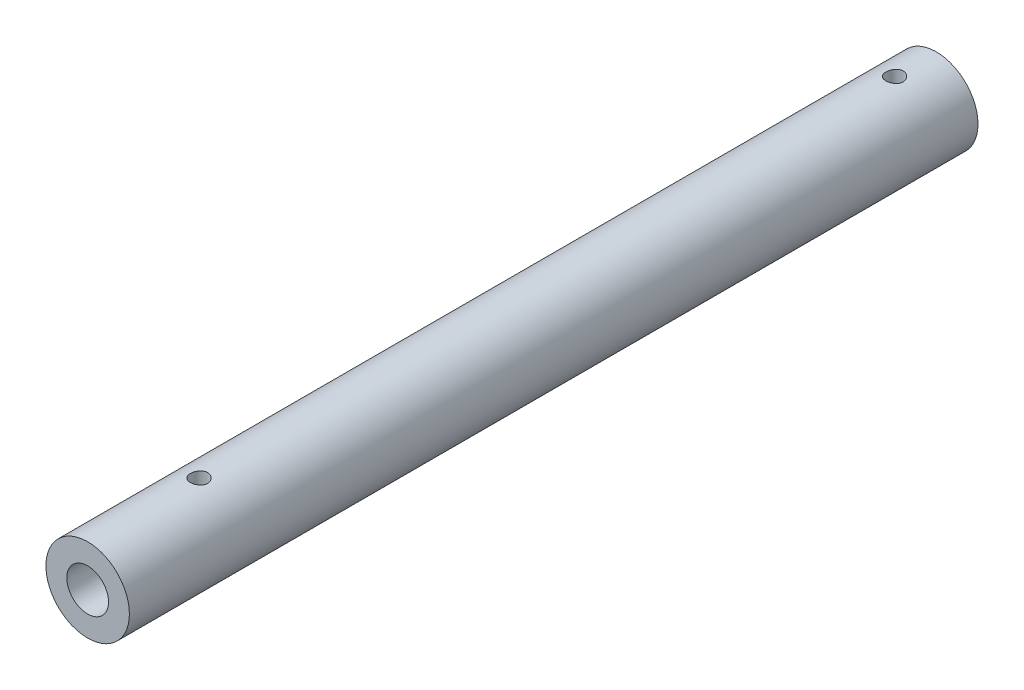
ISO-10303-21;
HEADER;
FILE_DESCRIPTION(('STEP AP214'),'2;1');
FILE_NAME('part.step','',(''),(''),'','','');
FILE_SCHEMA(('AUTOMOTIVE_DESIGN { 1 0 10303 214 1 1 1 1 }'));
ENDSEC;
DATA;
#1=APPLICATION_CONTEXT('core data for automotive mechanical design processes');
#2=APPLICATION_PROTOCOL_DEFINITION('international standard','automotive_design',2000,#1);
#3=PRODUCT_CONTEXT('',#1,'mechanical');
#4=PRODUCT('Part','Part','',(#3));
#5=PRODUCT_RELATED_PRODUCT_CATEGORY('part','',(#4));
#6=PRODUCT_DEFINITION_FORMATION('','',#4);
#7=PRODUCT_DEFINITION_CONTEXT('part definition',#1,'design');
#8=PRODUCT_DEFINITION('design','',#6,#7);
#9=PRODUCT_DEFINITION_SHAPE('','',#8);
#10=(LENGTH_UNIT() NAMED_UNIT(*) SI_UNIT(.MILLI.,.METRE.));
#11=(NAMED_UNIT(*) PLANE_ANGLE_UNIT() SI_UNIT($,.RADIAN.));
#12=(NAMED_UNIT(*) SI_UNIT($,.STERADIAN.) SOLID_ANGLE_UNIT());
#13=UNCERTAINTY_MEASURE_WITH_UNIT(LENGTH_MEASURE(1.E-05),#10,'distance_accuracy_value','');
#14=(GEOMETRIC_REPRESENTATION_CONTEXT(3) GLOBAL_UNCERTAINTY_ASSIGNED_CONTEXT((#13)) GLOBAL_UNIT_ASSIGNED_CONTEXT((#10,
#11,#12)) REPRESENTATION_CONTEXT('',''));
#15=CARTESIAN_POINT('',(0.,0.,0.));
#16=DIRECTION('',(0.,0.,1.));
#17=DIRECTION('',(1.,0.,0.));
#18=AXIS2_PLACEMENT_3D('',#15,#16,#17);
#19=CARTESIAN_POINT('',(0.,0.,-152.5));
#20=DIRECTION('',(0.,0.,1.));
#21=DIRECTION('',(1.,0.,0.));
#22=AXIS2_PLACEMENT_3D('',#19,#20,#21);
#23=CYLINDRICAL_SURFACE('',#22,15.);
#24=CARTESIAN_POINT('',(0.,0.,-152.5));
#25=DIRECTION('',(0.,0.,1.));
#26=DIRECTION('',(1.,0.,0.));
#27=AXIS2_PLACEMENT_3D('',#24,#25,#26);
#28=CIRCLE('',#27,15.);
#29=CARTESIAN_POINT('',(15.,0.,-152.5));
#30=VERTEX_POINT('',#29);
#31=EDGE_CURVE('E10',#30,#30,#28,.T.);
#32=ORIENTED_EDGE('',*,*,#31,.T.);
#33=EDGE_LOOP('',(#32));
#34=FACE_BOUND('',#33,.T.);
#35=CARTESIAN_POINT('',(0.,0.,152.5));
#36=DIRECTION('',(0.,0.,1.));
#37=DIRECTION('',(1.,0.,0.));
#38=AXIS2_PLACEMENT_3D('',#35,#36,#37);
#39=CIRCLE('',#38,15.);
#40=CARTESIAN_POINT('',(15.,0.,152.5));
#41=VERTEX_POINT('',#40);
#42=EDGE_CURVE('E63',#41,#41,#39,.T.);
#43=ORIENTED_EDGE('',*,*,#42,.F.);
#44=EDGE_LOOP('',(#43));
#45=FACE_BOUND('',#44,.T.);
#46=CARTESIAN_POINT('',(0.,15.,109.4));
#47=CARTESIAN_POINT('',(0.172165692568075,14.9999968145247,109.40000618457));
#48=CARTESIAN_POINT('',(0.344408344623985,14.997005579049,109.414390881014));
#49=CARTESIAN_POINT('',(0.684016768751701,14.9853616038391,109.471499057615));
#50=CARTESIAN_POINT('',(0.851378698493532,14.9767045230125,109.514244267549));
#51=CARTESIAN_POINT('',(1.17626714760312,14.9546945810427,109.626689905818));
#52=CARTESIAN_POINT('',(1.33380320695702,14.9413463608244,109.696363700585));
#53=CARTESIAN_POINT('',(1.63494054093474,14.9114015957254,109.860607679373));
#54=CARTESIAN_POINT('',(1.77854248092076,14.8948052060611,109.955176673833));
#55=CARTESIAN_POINT('',(2.04981400261251,14.8599203077403,110.167970705814));
#56=CARTESIAN_POINT('',(2.17725387792713,14.841612714398,110.28648547387));
#57=CARTESIAN_POINT('',(2.41059374938867,14.8055061029318,110.543184305505));
#58=CARTESIAN_POINT('',(2.51649198363873,14.7877071265103,110.681369976402));
#59=CARTESIAN_POINT('',(2.7047326274681,14.7544460628154,110.975156332992));
#60=CARTESIAN_POINT('',(2.78683486689836,14.7390084976833,111.130913928046));
#61=CARTESIAN_POINT('',(2.92361365563603,14.7124902368737,111.454385744111));
#62=CARTESIAN_POINT('',(2.97829310959916,14.7014090797868,111.622098696645));
#63=CARTESIAN_POINT('',(3.05792378241659,14.6850518417562,111.962241853876));
#64=CARTESIAN_POINT('',(3.08327931876006,14.6796968878264,112.134573532448));
#65=CARTESIAN_POINT('',(3.1047987188951,14.6751611480918,112.481121638894));
#66=CARTESIAN_POINT('',(3.10096577486346,14.6759796871273,112.655337858587));
#67=CARTESIAN_POINT('',(3.06454338331474,14.6836268744082,112.997735233949));
#68=CARTESIAN_POINT('',(3.03241955530401,14.6903582036209,113.165968419241));
#69=CARTESIAN_POINT('',(2.94106317686198,14.7089190681247,113.494604990454));
#70=CARTESIAN_POINT('',(2.88182925294597,14.7207488617187,113.655007979217));
#71=CARTESIAN_POINT('',(2.73749545783405,14.7482719850808,113.964761349049));
#72=CARTESIAN_POINT('',(2.65221295005859,14.7639924411575,114.114024117796));
#73=CARTESIAN_POINT('',(2.45833155039525,14.7975084496401,114.396294231118));
#74=CARTESIAN_POINT('',(2.34972980522963,14.8153042558583,114.529299583353));
#75=CARTESIAN_POINT('',(2.10980951412046,14.8513860400371,114.777964018986));
#76=CARTESIAN_POINT('',(1.9780940667111,14.8696748609556,114.893240085605));
#77=CARTESIAN_POINT('',(1.69699917981559,14.9043690302707,115.100124474423));
#78=CARTESIAN_POINT('',(1.5476194834134,14.920774351266,115.19173245232));
#79=CARTESIAN_POINT('',(1.23499644988395,14.949897695655,115.348759280562));
#80=CARTESIAN_POINT('',(1.07172936615428,14.9626092321176,115.414132133225));
#81=CARTESIAN_POINT('',(0.736208050305227,14.9828639201261,115.516412723749));
#82=CARTESIAN_POINT('',(0.563954985205529,14.9904077410196,115.55332414815));
#83=CARTESIAN_POINT('',(0.218640650723562,14.9993830838028,115.597086713271));
#84=CARTESIAN_POINT('',(0.0456484522187995,15.0009211054796,115.604461679909));
#85=CARTESIAN_POINT('',(-0.299096179156925,14.9980082795858,115.590355851714));
#86=CARTESIAN_POINT('',(-0.470848686046567,14.9935577925971,115.568876794247));
#87=CARTESIAN_POINT('',(-0.806532778422369,14.9792348501822,115.498107567809));
#88=CARTESIAN_POINT('',(-0.970523916752342,14.9694152228943,115.449088246188));
#89=CARTESIAN_POINT('',(-1.28795822388416,14.9454516233604,115.324927550587));
#90=CARTESIAN_POINT('',(-1.44140056223108,14.9313073111298,115.249784122801));
#91=CARTESIAN_POINT('',(-1.73557589191958,14.899998810058,115.074389568514));
#92=CARTESIAN_POINT('',(-1.87611842957524,14.8827978643853,114.973825711686));
#93=CARTESIAN_POINT('',(-2.13852141882692,14.8473663952166,114.750861250337));
#94=CARTESIAN_POINT('',(-2.26037971863337,14.8291357534649,114.628458134182));
#95=CARTESIAN_POINT('',(-2.48399401838079,14.7933375094228,114.362898224027));
#96=CARTESIAN_POINT('',(-2.58538928856014,14.7757855941988,114.219435189047));
#97=CARTESIAN_POINT('',(-2.76264557446455,14.7436744809272,113.917206821806));
#98=CARTESIAN_POINT('',(-2.83850764553234,14.7291151591989,113.758442122345));
#99=CARTESIAN_POINT('',(-2.96206237859332,14.704766460738,113.430938691601));
#100=CARTESIAN_POINT('',(-3.00990595506134,14.6949515802098,113.262258882349));
#101=CARTESIAN_POINT('',(-3.07651834817521,14.681151621117,112.919028213839));
#102=CARTESIAN_POINT('',(-3.09529124863372,14.6771657237085,112.744478182742));
#103=CARTESIAN_POINT('',(-3.10307030783304,14.6755226409731,112.398088801353));
#104=CARTESIAN_POINT('',(-3.09264711298509,14.6777441283759,112.226262590665));
#105=CARTESIAN_POINT('',(-3.04359493211143,14.6879932817592,111.886870134022));
#106=CARTESIAN_POINT('',(-3.00496620761723,14.6960208939033,111.719303848583));
#107=CARTESIAN_POINT('',(-2.90086151532537,14.716921819634,111.393582191028));
#108=CARTESIAN_POINT('',(-2.83546006555444,14.7297816752769,111.235402081932));
#109=CARTESIAN_POINT('',(-2.67973384395481,14.7589049039727,110.932172077593));
#110=CARTESIAN_POINT('',(-2.58940680339967,14.7751685868093,110.787123379167));
#111=CARTESIAN_POINT('',(-2.38446392361927,14.809635154064,110.511441834902));
#112=CARTESIAN_POINT('',(-2.26943782754735,14.8278678241242,110.381117642797));
#113=CARTESIAN_POINT('',(-2.01920377162769,14.8640090653401,110.14143294543));
#114=CARTESIAN_POINT('',(-1.88399117387354,14.8819175609528,110.03207727097));
#115=CARTESIAN_POINT('',(-1.59538198786284,14.9156320795551,109.836259613768));
#116=CARTESIAN_POINT('',(-1.44179699181802,14.931412025711,109.750070618688));
#117=CARTESIAN_POINT('',(-1.12203522871779,14.9588332815734,109.604863888172));
#118=CARTESIAN_POINT('',(-0.955869690892318,14.9704782304995,109.545822246729));
#119=CARTESIAN_POINT('',(-0.657833295489245,14.9861185683186,109.46770728621));
#120=CARTESIAN_POINT('',(-0.527631279793745,14.9912930325766,109.442363403325));
#121=CARTESIAN_POINT('',(-0.26496798438754,14.9982349131395,109.408507682225));
#122=CARTESIAN_POINT('',(-0.132506785912505,15.0000024516911,109.399995240065));
#123=CARTESIAN_POINT('',(0.,15.,109.4));
#124=B_SPLINE_CURVE_WITH_KNOTS('',3,(#46,#47,#48,#49,#50,#51,#52,#53,#54,#55,#56,#57,#58,#59,
#60,#61,#62,#63,#64,#65,#66,#67,#68,#69,#70,#71,#72,#73,#74,#75,#76,#77,#78,#79,#80,#81,#82,#83,
#84,#85,#86,#87,#88,#89,#90,#91,#92,#93,#94,#95,#96,#97,#98,#99,#100,#101,#102,#103,#104,#105,
#106,#107,#108,#109,#110,#111,#112,#113,#114,#115,#116,#117,#118,#119,#120,#121,#122,#123),
.UNSPECIFIED.,.T.,.F.,(4,2,2,2,2,2,2,2,2,2,2,2,2,2,2,2,2,2,2,2,2,2,2,2,2,2,2,2,2,2,2,2,2,2,2,2,
2,2,4),(0.,0.516012233354278,1.03242029170924,1.54831890115688,2.0641928640149,2.58672901286762,
3.10930788292938,3.63699074660936,4.16461770564984,4.68487960325834,5.20508460362236,
5.71688465009023,6.22871062886656,6.74421096019476,7.25977440270464,7.78525818005798,
8.31074960120178,8.83715837566194,9.36349895418799,9.88046246952416,10.3973948586867,
10.9093302438091,11.4213058850333,11.9399157526589,12.4585853017375,12.9857239359749,
13.5128407797481,14.037091690128,14.5612689477046,15.0752728884932,15.5892720633185,
16.1018502189675,16.6144750448609,17.1363837856733,17.6584126215688,18.1863470781732,
18.7138157401919,19.1109771901377,19.5081243889402),.UNSPECIFIED.);
#125=CARTESIAN_POINT('',(0.,15.,109.4));
#126=VERTEX_POINT('',#125);
#127=EDGE_CURVE('E73',#126,#126,#124,.T.);
#128=ORIENTED_EDGE('',*,*,#127,.T.);
#129=EDGE_LOOP('',(#128));
#130=FACE_BOUND('',#129,.T.);
#131=CARTESIAN_POINT('',(0.,15.,-140.6));
#132=CARTESIAN_POINT('',(0.172165692568075,14.9999968145247,-140.59999381543));
#133=CARTESIAN_POINT('',(0.344408344623984,14.997005579049,-140.585609118986));
#134=CARTESIAN_POINT('',(0.684016768751701,14.9853616038391,-140.528500942385));
#135=CARTESIAN_POINT('',(0.851378698493532,14.9767045230125,-140.485755732451));
#136=CARTESIAN_POINT('',(1.17626714760312,14.9546945810427,-140.373310094182));
#137=CARTESIAN_POINT('',(1.33380320695701,14.9413463608244,-140.303636299415));
#138=CARTESIAN_POINT('',(1.63494054093473,14.9114015957254,-140.139392320627));
#139=CARTESIAN_POINT('',(1.77854248092075,14.8948052060611,-140.044823326167));
#140=CARTESIAN_POINT('',(2.0498140026125,14.8599203077403,-139.832029294186));
#141=CARTESIAN_POINT('',(2.17725387792713,14.841612714398,-139.71351452613));
#142=CARTESIAN_POINT('',(2.41059374938868,14.8055061029318,-139.456815694495));
#143=CARTESIAN_POINT('',(2.51649198363873,14.7877071265103,-139.318630023598));
#144=CARTESIAN_POINT('',(2.70473262746811,14.7544460628154,-139.024843667008));
#145=CARTESIAN_POINT('',(2.78683486689836,14.7390084976833,-138.869086071954));
#146=CARTESIAN_POINT('',(2.92361365563604,14.7124902368737,-138.545614255889));
#147=CARTESIAN_POINT('',(2.97829310959917,14.7014090797868,-138.377901303355));
#148=CARTESIAN_POINT('',(3.05792378241659,14.6850518417562,-138.037758146124));
#149=CARTESIAN_POINT('',(3.08327931876006,14.6796968878264,-137.865426467552));
#150=CARTESIAN_POINT('',(3.1047987188951,14.6751611480918,-137.518878361106));
#151=CARTESIAN_POINT('',(3.10096577486346,14.6759796871273,-137.344662141413));
#152=CARTESIAN_POINT('',(3.06454338331475,14.6836268744082,-137.002264766051));
#153=CARTESIAN_POINT('',(3.03241955530402,14.6903582036209,-136.834031580759));
#154=CARTESIAN_POINT('',(2.941063176862,14.7089190681247,-136.505395009546));
#155=CARTESIAN_POINT('',(2.88182925294598,14.7207488617187,-136.344992020783));
#156=CARTESIAN_POINT('',(2.73749545783407,14.7482719850807,-136.035238650951));
#157=CARTESIAN_POINT('',(2.65221295005861,14.7639924411575,-135.885975882204));
#158=CARTESIAN_POINT('',(2.45833155039526,14.7975084496401,-135.603705768882));
#159=CARTESIAN_POINT('',(2.34972980522964,14.8153042558583,-135.470700416647));
#160=CARTESIAN_POINT('',(2.10980951412048,14.8513860400371,-135.222035981014));
#161=CARTESIAN_POINT('',(1.97809406671112,14.8696748609556,-135.106759914395));
#162=CARTESIAN_POINT('',(1.69699917981562,14.9043690302707,-134.899875525577));
#163=CARTESIAN_POINT('',(1.54761948341342,14.920774351266,-134.80826754768));
#164=CARTESIAN_POINT('',(1.23499644988397,14.949897695655,-134.651240719438));
#165=CARTESIAN_POINT('',(1.07172936615429,14.9626092321176,-134.585867866775));
#166=CARTESIAN_POINT('',(0.736208050305236,14.9828639201261,-134.483587276251));
#167=CARTESIAN_POINT('',(0.563954985205532,14.9904077410196,-134.44667585185));
#168=CARTESIAN_POINT('',(0.218640650723563,14.9993830838028,-134.402913286729));
#169=CARTESIAN_POINT('',(0.0456484522188022,15.0009211054796,-134.395538320091));
#170=CARTESIAN_POINT('',(-0.29909617915692,14.9980082795858,-134.409644148286));
#171=CARTESIAN_POINT('',(-0.47084868604656,14.9935577925971,-134.431123205753));
#172=CARTESIAN_POINT('',(-0.806532778422362,14.9792348501822,-134.501892432191));
#173=CARTESIAN_POINT('',(-0.970523916752336,14.9694152228943,-134.550911753812));
#174=CARTESIAN_POINT('',(-1.28795822388415,14.9454516233604,-134.675072449413));
#175=CARTESIAN_POINT('',(-1.44140056223108,14.9313073111298,-134.750215877199));
#176=CARTESIAN_POINT('',(-1.73557589191957,14.899998810058,-134.925610431486));
#177=CARTESIAN_POINT('',(-1.87611842957523,14.8827978643853,-135.026174288314));
#178=CARTESIAN_POINT('',(-2.13852141882691,14.8473663952166,-135.249138749663));
#179=CARTESIAN_POINT('',(-2.26037971863336,14.8291357534649,-135.371541865818));
#180=CARTESIAN_POINT('',(-2.48399401838078,14.7933375094228,-135.637101775973));
#181=CARTESIAN_POINT('',(-2.58538928856012,14.7757855941988,-135.780564810952));
#182=CARTESIAN_POINT('',(-2.76264557446454,14.7436744809272,-136.082793178194));
#183=CARTESIAN_POINT('',(-2.83850764553234,14.729115159199,-136.241557877655));
#184=CARTESIAN_POINT('',(-2.96206237859333,14.704766460738,-136.569061308399));
#185=CARTESIAN_POINT('',(-3.00990595506134,14.6949515802098,-136.737741117651));
#186=CARTESIAN_POINT('',(-3.07651834817521,14.681151621117,-137.080971786161));
#187=CARTESIAN_POINT('',(-3.09529124863372,14.6771657237085,-137.255521817258));
#188=CARTESIAN_POINT('',(-3.10307030783304,14.6755226409731,-137.601911198647));
#189=CARTESIAN_POINT('',(-3.09264711298509,14.6777441283759,-137.773737409335));
#190=CARTESIAN_POINT('',(-3.04359493211143,14.6879932817592,-138.113129865978));
#191=CARTESIAN_POINT('',(-3.00496620761724,14.6960208939033,-138.280696151417));
#192=CARTESIAN_POINT('',(-2.90086151532537,14.716921819634,-138.606417808972));
#193=CARTESIAN_POINT('',(-2.83546006555443,14.7297816752769,-138.764597918068));
#194=CARTESIAN_POINT('',(-2.67973384395481,14.7589049039727,-139.067827922407));
#195=CARTESIAN_POINT('',(-2.58940680339968,14.7751685868093,-139.212876620833));
#196=CARTESIAN_POINT('',(-2.38446392361929,14.809635154064,-139.488558165098));
#197=CARTESIAN_POINT('',(-2.26943782754737,14.8278678241242,-139.618882357203));
#198=CARTESIAN_POINT('',(-2.01920377162769,14.8640090653401,-139.85856705457));
#199=CARTESIAN_POINT('',(-1.88399117387354,14.8819175609528,-139.96792272903));
#200=CARTESIAN_POINT('',(-1.59538198786284,14.9156320795551,-140.163740386232));
#201=CARTESIAN_POINT('',(-1.44179699181802,14.931412025711,-140.249929381312));
#202=CARTESIAN_POINT('',(-1.1220352287178,14.9588332815734,-140.395136111828));
#203=CARTESIAN_POINT('',(-0.95586969089233,14.9704782304995,-140.454177753271));
#204=CARTESIAN_POINT('',(-0.657833295489254,14.9861185683186,-140.53229271379));
#205=CARTESIAN_POINT('',(-0.527631279793751,14.9912930325766,-140.557636596675));
#206=CARTESIAN_POINT('',(-0.264967984387543,14.9982349131395,-140.591492317775));
#207=CARTESIAN_POINT('',(-0.132506785912507,15.0000024516911,-140.600004759935));
#208=CARTESIAN_POINT('',(0.,15.,-140.6));
#209=B_SPLINE_CURVE_WITH_KNOTS('',3,(#131,#132,#133,#134,#135,#136,#137,#138,#139,#140,#141,
#142,#143,#144,#145,#146,#147,#148,#149,#150,#151,#152,#153,#154,#155,#156,#157,#158,#159,#160,
#161,#162,#163,#164,#165,#166,#167,#168,#169,#170,#171,#172,#173,#174,#175,#176,#177,#178,#179,
#180,#181,#182,#183,#184,#185,#186,#187,#188,#189,#190,#191,#192,#193,#194,#195,#196,#197,#198,
#199,#200,#201,#202,#203,#204,#205,#206,#207,#208),.UNSPECIFIED.,.T.,.F.,(4,2,2,2,2,2,2,2,2,2,2,
2,2,2,2,2,2,2,2,2,2,2,2,2,2,2,2,2,2,2,2,2,2,2,2,2,2,2,4),(0.,0.516012233354276,1.03242029170924,
1.54831890115687,2.06419286401491,2.58672901286762,3.10930788292938,3.63699074660936,
4.16461770564988,4.68487960325835,5.20508460362237,5.71688465009023,6.22871062886655,
6.74421096019477,7.25977440270464,7.78525818005795,8.31074960120177,8.83715837566196,
9.36349895418801,9.88046246952418,10.3973948586867,10.9093302438091,11.4213058850333,
11.9399157526589,12.4585853017375,12.9857239359749,13.5128407797481,14.0370916901281,
14.5612689477046,15.0752728884932,15.5892720633185,16.1018502189676,16.6144750448609,
17.1363837856733,17.6584126215689,18.1863470781733,18.7138157401919,19.1109771901377,
19.5081243889402),.UNSPECIFIED.);
#210=CARTESIAN_POINT('',(0.,15.,-140.6));
#211=VERTEX_POINT('',#210);
#212=EDGE_CURVE('E74',#211,#211,#209,.T.);
#213=ORIENTED_EDGE('',*,*,#212,.T.);
#214=EDGE_LOOP('',(#213));
#215=FACE_BOUND('',#214,.T.);
#216=ADVANCED_FACE('F43',(#34,#45,#130,#215),#23,.T.);
#217=CARTESIAN_POINT('',(0.,0.,-152.5));
#218=DIRECTION('',(0.,0.,1.));
#219=DIRECTION('',(1.,0.,0.));
#220=AXIS2_PLACEMENT_3D('',#217,#218,#219);
#221=CYLINDRICAL_SURFACE('',#220,7.5);
#222=CARTESIAN_POINT('',(0.,0.,-152.5));
#223=DIRECTION('',(0.,0.,1.));
#224=DIRECTION('',(1.,0.,0.));
#225=AXIS2_PLACEMENT_3D('',#222,#223,#224);
#226=CIRCLE('',#225,7.5);
#227=CARTESIAN_POINT('',(7.5,0.,-152.5));
#228=VERTEX_POINT('',#227);
#229=EDGE_CURVE('E57',#228,#228,#226,.T.);
#230=ORIENTED_EDGE('',*,*,#229,.F.);
#231=EDGE_LOOP('',(#230));
#232=FACE_BOUND('',#231,.T.);
#233=CARTESIAN_POINT('',(0.,0.,152.5));
#234=DIRECTION('',(0.,0.,1.));
#235=DIRECTION('',(1.,0.,0.));
#236=AXIS2_PLACEMENT_3D('',#233,#234,#235);
#237=CIRCLE('',#236,7.5);
#238=CARTESIAN_POINT('',(7.5,0.,152.5));
#239=VERTEX_POINT('',#238);
#240=EDGE_CURVE('E94',#239,#239,#237,.T.);
#241=ORIENTED_EDGE('',*,*,#240,.T.);
#242=EDGE_LOOP('',(#241));
#243=FACE_BOUND('',#242,.T.);
#244=CARTESIAN_POINT('',(0.,7.5,109.4));
#245=CARTESIAN_POINT('',(0.166153002613095,7.49999499657015,109.400006439139));
#246=CARTESIAN_POINT('',(0.332600464403827,7.49441556709234,109.413437102607));
#247=CARTESIAN_POINT('',(0.660768761003522,7.47265556326767,109.466659456979));
#248=CARTESIAN_POINT('',(0.822475981409229,7.45644708598611,109.50652053498));
#249=CARTESIAN_POINT('',(1.13589928883872,7.41516232897275,109.610897830234));
#250=CARTESIAN_POINT('',(1.28764700409263,7.39011591076245,109.675331081826));
#251=CARTESIAN_POINT('',(1.57803340286612,7.33360222650622,109.82668057778));
#252=CARTESIAN_POINT('',(1.71667615552021,7.30213696318032,109.913589811752));
#253=CARTESIAN_POINT('',(1.98400959910196,7.23419554679821,110.11197764626));
#254=CARTESIAN_POINT('',(2.11196525773685,7.19755699911941,110.224390668417));
#255=CARTESIAN_POINT('',(2.34783768718455,7.12411042208018,110.468619929221));
#256=CARTESIAN_POINT('',(2.45574406182103,7.08730231487861,110.600446171071));
#257=CARTESIAN_POINT('',(2.65359473144149,7.01570032840253,110.887471400951));
#258=CARTESIAN_POINT('',(2.74242148647984,6.98108925988135,111.043491095404));
#259=CARTESIAN_POINT('',(2.89224243961144,6.9203697427042,111.369896741966));
#260=CARTESIAN_POINT('',(2.9532507497489,6.89425698486145,111.540275357834));
#261=CARTESIAN_POINT('',(3.04268024888773,6.8552453498953,111.882104091265));
#262=CARTESIAN_POINT('',(3.07251470951095,6.84177651513845,112.053116939132));
#263=CARTESIAN_POINT('',(3.10316007729673,6.82793602371857,112.398211058538));
#264=CARTESIAN_POINT('',(3.10398662811009,6.82755730769831,112.572290625546));
#265=CARTESIAN_POINT('',(3.07765851268914,6.83945669009683,112.904603117149));
#266=CARTESIAN_POINT('',(3.05260360053315,6.85078502883839,113.063043193012));
#267=CARTESIAN_POINT('',(2.97874158057689,6.88321931438638,113.373228128714));
#268=CARTESIAN_POINT('',(2.92993000846889,6.90432709889237,113.524971724314));
#269=CARTESIAN_POINT('',(2.80899254802325,6.95441629953129,113.82125495533));
#270=CARTESIAN_POINT('',(2.73639615555451,6.98355455159122,113.965574835102));
#271=CARTESIAN_POINT('',(2.57028194875633,7.04638370508448,114.240539248003));
#272=CARTESIAN_POINT('',(2.47675595937094,7.0800763834253,114.371178408124));
#273=CARTESIAN_POINT('',(2.26231791362187,7.15162260147758,114.62649017387));
#274=CARTESIAN_POINT('',(2.13977666022389,7.18958932893573,114.749766523274));
#275=CARTESIAN_POINT('',(1.87537753928265,7.26304146095989,114.97448333847));
#276=CARTESIAN_POINT('',(1.73351530071415,7.29852630128623,115.075918849724));
#277=CARTESIAN_POINT('',(1.43031567972321,7.3640172601883,115.256077758159));
#278=CARTESIAN_POINT('',(1.2686134301535,7.3938829557076,115.334241913309));
#279=CARTESIAN_POINT('',(0.932805541489826,7.44369617955768,115.461770039552));
#280=CARTESIAN_POINT('',(0.758706702716542,7.46364909848067,115.511149666282));
#281=CARTESIAN_POINT('',(0.414723271042759,7.49038660533013,115.576804702462));
#282=CARTESIAN_POINT('',(0.245254188339041,7.49791555875999,115.594954434622));
#283=CARTESIAN_POINT('',(-0.0944609767199287,7.50132646954416,115.603211537545));
#284=CARTESIAN_POINT('',(-0.264706827033575,7.4972117034244,115.593326797167));
#285=CARTESIAN_POINT('',(-0.592423142194312,7.4782813005357,115.547145000089));
#286=CARTESIAN_POINT('',(-0.750112133817271,7.46399615818736,115.512156687961));
#287=CARTESIAN_POINT('',(-1.05721523253207,7.42672470407196,115.418574109654));
#288=CARTESIAN_POINT('',(-1.20662828750662,7.40373728888471,115.359976849877));
#289=CARTESIAN_POINT('',(-1.49816127489848,7.35038535240201,115.218924328521));
#290=CARTESIAN_POINT('',(-1.63991168325742,7.31981428517995,115.135785962502));
#291=CARTESIAN_POINT('',(-1.90795528937434,7.25456871961594,114.948763178137));
#292=CARTESIAN_POINT('',(-2.03424204531876,7.21989252291917,114.844870160969));
#293=CARTESIAN_POINT('',(-2.27711097618434,7.14716389966531,114.61072920737));
#294=CARTESIAN_POINT('',(-2.3923848065296,7.10904560593693,114.479141117405));
#295=CARTESIAN_POINT('',(-2.59957048468989,7.03593167919986,114.197866140141));
#296=CARTESIAN_POINT('',(-2.69147733770028,7.00093671485367,114.048175393385));
#297=CARTESIAN_POINT('',(-2.85022442048547,6.93784170380674,113.732030802691));
#298=CARTESIAN_POINT('',(-2.91671570889454,6.90983935005117,113.565380814679));
#299=CARTESIAN_POINT('',(-3.02013779062217,6.86527482101638,113.221731553331));
#300=CARTESIAN_POINT('',(-3.05709243461338,6.84870341679441,113.044740754336));
#301=CARTESIAN_POINT('',(-3.09804010789086,6.83027124265743,112.699926426674));
#302=CARTESIAN_POINT('',(-3.10432447712995,6.82738831148697,112.532428294473));
#303=CARTESIAN_POINT('',(-3.08985007296315,6.8339513608338,112.198868064823));
#304=CARTESIAN_POINT('',(-3.06909529490485,6.84339551988095,112.032805758864));
#305=CARTESIAN_POINT('',(-3.00304618929305,6.87262082828988,111.714536568116));
#306=CARTESIAN_POINT('',(-2.95890039997519,6.89191674393385,111.562042558786));
#307=CARTESIAN_POINT('',(-2.84843476313012,6.93829866651058,111.266584992252));
#308=CARTESIAN_POINT('',(-2.78210870560485,6.96538685481484,111.123624117579));
#309=CARTESIAN_POINT('',(-2.62461324834435,7.0263027906572,110.841998592494));
#310=CARTESIAN_POINT('',(-2.53219913435248,7.06043592217453,110.704097378428));
#311=CARTESIAN_POINT('',(-2.32690149913443,7.13072826622725,110.44504024527));
#312=CARTESIAN_POINT('',(-2.21401106371445,7.16688816027646,110.323890006869));
#313=CARTESIAN_POINT('',(-1.96144980129081,7.24024921308954,110.092916152182));
#314=CARTESIAN_POINT('',(-1.82044465095393,7.2773412567495,109.984512756864));
#315=CARTESIAN_POINT('',(-1.52076323380495,7.34580237908539,109.792812658807));
#316=CARTESIAN_POINT('',(-1.36207893610267,7.37716883966076,109.709527430395));
#317=CARTESIAN_POINT('',(-1.11564028430044,7.4170196735755,109.606361942525));
#318=CARTESIAN_POINT('',(-1.03279444562304,7.42903456588252,109.575762581434));
#319=CARTESIAN_POINT('',(-0.864502653411405,7.45049041775363,109.521673252691));
#320=CARTESIAN_POINT('',(-0.779057950570111,7.45993259430367,109.498179923053));
#321=CARTESIAN_POINT('',(-0.606439030534127,7.4759436159557,109.45860916377));
#322=CARTESIAN_POINT('',(-0.51926966743141,7.48251958049345,109.442513353808));
#323=CARTESIAN_POINT('',(-0.343742028836114,7.49263353478285,109.417844081351));
#324=CARTESIAN_POINT('',(-0.255384680685453,7.49617376860472,109.409265062197));
#325=CARTESIAN_POINT('',(-0.139047150358914,7.49876251103851,109.402994945568));
#326=CARTESIAN_POINT('',(-0.111252100871378,7.4992261831606,109.401872324235));
#327=CARTESIAN_POINT('',(-0.0556407868836701,7.4998453469052,109.400374311519));
#328=CARTESIAN_POINT('',(-0.0278245223397607,7.50000083789064,109.399998921681));
#329=CARTESIAN_POINT('',(0.,7.5,109.4));
#330=B_SPLINE_CURVE_WITH_KNOTS('',3,(#244,#245,#246,#247,#248,#249,#250,#251,#252,#253,#254,
#255,#256,#257,#258,#259,#260,#261,#262,#263,#264,#265,#266,#267,#268,#269,#270,#271,#272,#273,
#274,#275,#276,#277,#278,#279,#280,#281,#282,#283,#284,#285,#286,#287,#288,#289,#290,#291,#292,
#293,#294,#295,#296,#297,#298,#299,#300,#301,#302,#303,#304,#305,#306,#307,#308,#309,#310,#311,
#312,#313,#314,#315,#316,#317,#318,#319,#320,#321,#322,#323,#324,#325,#326,#327,#328,#329),
.UNSPECIFIED.,.T.,.F.,(4,2,2,2,2,2,2,2,2,2,2,2,2,2,2,2,2,2,2,2,2,2,2,2,2,2,2,2,2,2,2,2,2,2,2,2,
2,2,2,2,2,2,4),(0.,0.498350072093011,0.998013657585998,1.49600490175053,1.9938410065071,
2.51422237468693,3.03487282828191,3.580638368968,4.12612673889393,4.64564263404287,
5.16487835560279,5.64506306376058,6.12533804220391,6.61575367999806,7.10636120848079,
7.63770794739143,8.16917509423629,8.71253919590831,9.25560749053008,9.7647703429197,
10.2737899318644,10.758038466616,11.2423484231004,11.7416676385666,12.2411941567272,
12.7758736132641,13.310667264219,13.8525600209146,14.3940147589522,14.8943247334461,
15.394560789723,15.8722439818826,16.3500610271901,16.8563461469572,17.3628025422318,
17.9053115722873,18.448068053912,18.7151630289678,18.9821314383947,19.2484328877127,
19.5145373117832,19.5979924635494,19.6814477878343),.UNSPECIFIED.);
#331=CARTESIAN_POINT('',(0.,7.5,109.4));
#332=VERTEX_POINT('',#331);
#333=EDGE_CURVE('E66',#332,#332,#330,.T.);
#334=ORIENTED_EDGE('',*,*,#333,.F.);
#335=EDGE_LOOP('',(#334));
#336=FACE_BOUND('',#335,.T.);
#337=CARTESIAN_POINT('',(0.,7.5,-140.6));
#338=CARTESIAN_POINT('',(0.166153002613096,7.49999499657015,-140.599993560861));
#339=CARTESIAN_POINT('',(0.332600464403828,7.49441556709234,-140.586562897393));
#340=CARTESIAN_POINT('',(0.660768761003523,7.47265556326767,-140.533340543021));
#341=CARTESIAN_POINT('',(0.822475981409231,7.4564470859861,-140.49347946502));
#342=CARTESIAN_POINT('',(1.13589928883872,7.41516232897275,-140.389102169766));
#343=CARTESIAN_POINT('',(1.28764700409263,7.39011591076245,-140.324668918174));
#344=CARTESIAN_POINT('',(1.57803340286612,7.33360222650622,-140.17331942222));
#345=CARTESIAN_POINT('',(1.71667615552021,7.30213696318032,-140.086410188248));
#346=CARTESIAN_POINT('',(1.98400959910197,7.23419554679821,-139.88802235374));
#347=CARTESIAN_POINT('',(2.11196525773686,7.19755699911941,-139.775609331583));
#348=CARTESIAN_POINT('',(2.34783768718456,7.12411042208018,-139.531380070779));
#349=CARTESIAN_POINT('',(2.45574406182104,7.0873023148786,-139.399553828929));
#350=CARTESIAN_POINT('',(2.6535947314415,7.01570032840252,-139.112528599049));
#351=CARTESIAN_POINT('',(2.74242148647984,6.98108925988135,-138.956508904596));
#352=CARTESIAN_POINT('',(2.89224243961144,6.9203697427042,-138.630103258034));
#353=CARTESIAN_POINT('',(2.9532507497489,6.89425698486144,-138.459724642166));
#354=CARTESIAN_POINT('',(3.04268024888773,6.8552453498953,-138.117895908735));
#355=CARTESIAN_POINT('',(3.07251470951095,6.84177651513845,-137.946883060868));
#356=CARTESIAN_POINT('',(3.10316007729673,6.82793602371857,-137.601788941462));
#357=CARTESIAN_POINT('',(3.1039866281101,6.82755730769831,-137.427709374454));
#358=CARTESIAN_POINT('',(3.07765851268915,6.83945669009682,-137.095396882851));
#359=CARTESIAN_POINT('',(3.05260360053316,6.85078502883839,-136.936956806988));
#360=CARTESIAN_POINT('',(2.97874158057689,6.88321931438638,-136.626771871286));
#361=CARTESIAN_POINT('',(2.92993000846889,6.90432709889237,-136.475028275686));
#362=CARTESIAN_POINT('',(2.80899254802325,6.95441629953129,-136.17874504467));
#363=CARTESIAN_POINT('',(2.73639615555451,6.98355455159122,-136.034425164898));
#364=CARTESIAN_POINT('',(2.57028194875633,7.04638370508448,-135.759460751997));
#365=CARTESIAN_POINT('',(2.47675595937095,7.0800763834253,-135.628821591876));
#366=CARTESIAN_POINT('',(2.26231791362187,7.15162260147758,-135.37350982613));
#367=CARTESIAN_POINT('',(2.13977666022389,7.18958932893573,-135.250233476726));
#368=CARTESIAN_POINT('',(1.87537753928264,7.26304146095989,-135.02551666153));
#369=CARTESIAN_POINT('',(1.73351530071415,7.29852630128623,-134.924081150276));
#370=CARTESIAN_POINT('',(1.43031567972321,7.3640172601883,-134.743922241841));
#371=CARTESIAN_POINT('',(1.2686134301535,7.3938829557076,-134.665758086691));
#372=CARTESIAN_POINT('',(0.932805541489829,7.44369617955768,-134.538229960448));
#373=CARTESIAN_POINT('',(0.758706702716551,7.46364909848067,-134.488850333718));
#374=CARTESIAN_POINT('',(0.414723271042771,7.49038660533013,-134.423195297538));
#375=CARTESIAN_POINT('',(0.245254188339051,7.49791555875999,-134.405045565378));
#376=CARTESIAN_POINT('',(-0.0944609767199203,7.50132646954416,-134.396788462455));
#377=CARTESIAN_POINT('',(-0.264706827033566,7.4972117034244,-134.406673202833));
#378=CARTESIAN_POINT('',(-0.592423142194306,7.4782813005357,-134.452854999911));
#379=CARTESIAN_POINT('',(-0.750112133817268,7.46399615818736,-134.487843312039));
#380=CARTESIAN_POINT('',(-1.05721523253207,7.42672470407196,-134.581425890346));
#381=CARTESIAN_POINT('',(-1.20662828750662,7.40373728888471,-134.640023150123));
#382=CARTESIAN_POINT('',(-1.49816127489848,7.35038535240201,-134.781075671479));
#383=CARTESIAN_POINT('',(-1.63991168325742,7.31981428517996,-134.864214037498));
#384=CARTESIAN_POINT('',(-1.90795528937434,7.25456871961595,-135.051236821863));
#385=CARTESIAN_POINT('',(-2.03424204531875,7.21989252291917,-135.155129839031));
#386=CARTESIAN_POINT('',(-2.27711097618433,7.14716389966532,-135.38927079263));
#387=CARTESIAN_POINT('',(-2.39238480652959,7.10904560593693,-135.520858882595));
#388=CARTESIAN_POINT('',(-2.59957048468988,7.03593167919986,-135.802133859859));
#389=CARTESIAN_POINT('',(-2.69147733770028,7.00093671485367,-135.951824606615));
#390=CARTESIAN_POINT('',(-2.85022442048548,6.93784170380673,-136.267969197309));
#391=CARTESIAN_POINT('',(-2.91671570889455,6.90983935005117,-136.434619185321));
#392=CARTESIAN_POINT('',(-3.02013779062217,6.86527482101638,-136.778268446669));
#393=CARTESIAN_POINT('',(-3.05709243461339,6.84870341679441,-136.955259245664));
#394=CARTESIAN_POINT('',(-3.09804010789086,6.83027124265743,-137.300073573326));
#395=CARTESIAN_POINT('',(-3.10432447712996,6.82738831148697,-137.467571705527));
#396=CARTESIAN_POINT('',(-3.08985007296316,6.8339513608338,-137.801131935177));
#397=CARTESIAN_POINT('',(-3.06909529490486,6.84339551988095,-137.967194241136));
#398=CARTESIAN_POINT('',(-3.00304618929306,6.87262082828987,-138.285463431884));
#399=CARTESIAN_POINT('',(-2.95890039997521,6.89191674393384,-138.437957441214));
#400=CARTESIAN_POINT('',(-2.84843476313013,6.93829866651057,-138.733415007748));
#401=CARTESIAN_POINT('',(-2.78210870560485,6.96538685481484,-138.876375882421));
#402=CARTESIAN_POINT('',(-2.62461324834434,7.0263027906572,-139.158001407506));
#403=CARTESIAN_POINT('',(-2.53219913435248,7.06043592217453,-139.295902621572));
#404=CARTESIAN_POINT('',(-2.32690149913443,7.13072826622725,-139.55495975473));
#405=CARTESIAN_POINT('',(-2.21401106371445,7.16688816027646,-139.676109993131));
#406=CARTESIAN_POINT('',(-1.96144980129082,7.24024921308954,-139.907083847818));
#407=CARTESIAN_POINT('',(-1.82044465095395,7.27734125674949,-140.015487243136));
#408=CARTESIAN_POINT('',(-1.52076323380497,7.34580237908539,-140.207187341193));
#409=CARTESIAN_POINT('',(-1.3620789361027,7.37716883966076,-140.290472569605));
#410=CARTESIAN_POINT('',(-1.11564028430046,7.4170196735755,-140.393638057475));
#411=CARTESIAN_POINT('',(-1.03279444562307,7.42903456588251,-140.424237418566));
#412=CARTESIAN_POINT('',(-0.864502653411428,7.45049041775362,-140.478326747309));
#413=CARTESIAN_POINT('',(-0.779057950570132,7.45993259430366,-140.501820076947));
#414=CARTESIAN_POINT('',(-0.606439030534142,7.4759436159557,-140.54139083623));
#415=CARTESIAN_POINT('',(-0.519269667431423,7.48251958049345,-140.557486646192));
#416=CARTESIAN_POINT('',(-0.343742028836122,7.49263353478285,-140.582155918649));
#417=CARTESIAN_POINT('',(-0.255384680685458,7.49617376860472,-140.590734937803));
#418=CARTESIAN_POINT('',(-0.139047150358916,7.49876251103851,-140.597005054432));
#419=CARTESIAN_POINT('',(-0.111252100871381,7.4992261831606,-140.598127675765));
#420=CARTESIAN_POINT('',(-0.0556407868836723,7.4998453469052,-140.599625688481));
#421=CARTESIAN_POINT('',(-0.0278245223397618,7.50000083789064,-140.600001078319));
#422=CARTESIAN_POINT('',(0.,7.5,-140.6));
#423=B_SPLINE_CURVE_WITH_KNOTS('',3,(#337,#338,#339,#340,#341,#342,#343,#344,#345,#346,#347,
#348,#349,#350,#351,#352,#353,#354,#355,#356,#357,#358,#359,#360,#361,#362,#363,#364,#365,#366,
#367,#368,#369,#370,#371,#372,#373,#374,#375,#376,#377,#378,#379,#380,#381,#382,#383,#384,#385,
#386,#387,#388,#389,#390,#391,#392,#393,#394,#395,#396,#397,#398,#399,#400,#401,#402,#403,#404,
#405,#406,#407,#408,#409,#410,#411,#412,#413,#414,#415,#416,#417,#418,#419,#420,#421,#422),
.UNSPECIFIED.,.T.,.F.,(4,2,2,2,2,2,2,2,2,2,2,2,2,2,2,2,2,2,2,2,2,2,2,2,2,2,2,2,2,2,2,2,2,2,2,2,
2,2,2,2,2,2,4),(0.,0.498350072093011,0.998013657585997,1.49600490175053,1.99384100650711,
2.51422237468694,3.03487282828192,3.58063836896801,4.12612673889392,4.64564263404288,
5.1648783556028,5.64506306376062,6.12533804220394,6.61575367999806,7.10636120848081,
7.63770794739144,8.16917509423632,8.71253919590832,9.25560749053009,9.76477034291971,
10.2737899318644,10.758038466616,11.2423484231004,11.7416676385667,12.2411941567272,
12.7758736132641,13.310667264219,13.8525600209146,14.3940147589522,14.8943247334461,
15.394560789723,15.8722439818826,16.3500610271901,16.8563461469572,17.3628025422318,
17.9053115722873,18.448068053912,18.7151630289678,18.9821314383947,19.2484328877127,
19.5145373117832,19.5979924635495,19.6814477878343),.UNSPECIFIED.);
#424=CARTESIAN_POINT('',(0.,7.5,-140.6));
#425=VERTEX_POINT('',#424);
#426=EDGE_CURVE('E47',#425,#425,#423,.T.);
#427=ORIENTED_EDGE('',*,*,#426,.F.);
#428=EDGE_LOOP('',(#427));
#429=FACE_BOUND('',#428,.T.);
#430=ADVANCED_FACE('F75',(#232,#243,#336,#429),#221,.F.);
#431=CARTESIAN_POINT('',(0.,0.,-152.5));
#432=DIRECTION('',(0.,0.,1.));
#433=DIRECTION('',(1.,0.,0.));
#434=AXIS2_PLACEMENT_3D('',#431,#432,#433);
#435=PLANE('',#434);
#436=ORIENTED_EDGE('',*,*,#229,.T.);
#437=EDGE_LOOP('',(#436));
#438=FACE_BOUND('',#437,.T.);
#439=ORIENTED_EDGE('',*,*,#31,.F.);
#440=EDGE_LOOP('',(#439));
#441=FACE_BOUND('',#440,.T.);
#442=ADVANCED_FACE('F120',(#438,#441),#435,.F.);
#443=CARTESIAN_POINT('',(0.,0.,152.5));
#444=DIRECTION('',(0.,0.,1.));
#445=DIRECTION('',(1.,0.,0.));
#446=AXIS2_PLACEMENT_3D('',#443,#444,#445);
#447=PLANE('',#446);
#448=ORIENTED_EDGE('',*,*,#42,.T.);
#449=EDGE_LOOP('',(#448));
#450=FACE_BOUND('',#449,.T.);
#451=ORIENTED_EDGE('',*,*,#240,.F.);
#452=EDGE_LOOP('',(#451));
#453=FACE_BOUND('',#452,.T.);
#454=ADVANCED_FACE('F82',(#450,#453),#447,.T.);
#455=CARTESIAN_POINT('',(0.,15.,112.5));
#456=DIRECTION('',(0.,-1.,0.));
#457=DIRECTION('',(0.,0.,-1.));
#458=AXIS2_PLACEMENT_3D('',#455,#456,#457);
#459=CYLINDRICAL_SURFACE('',#458,3.09999999999999);
#460=ORIENTED_EDGE('',*,*,#127,.F.);
#461=EDGE_LOOP('',(#460));
#462=FACE_BOUND('',#461,.T.);
#463=ORIENTED_EDGE('',*,*,#333,.T.);
#464=EDGE_LOOP('',(#463));
#465=FACE_BOUND('',#464,.T.);
#466=ADVANCED_FACE('F78',(#462,#465),#459,.F.);
#467=CARTESIAN_POINT('',(0.,15.,-137.5));
#468=DIRECTION('',(0.,-1.,0.));
#469=DIRECTION('',(0.,0.,-1.));
#470=AXIS2_PLACEMENT_3D('',#467,#468,#469);
#471=CYLINDRICAL_SURFACE('',#470,3.1);
#472=ORIENTED_EDGE('',*,*,#212,.F.);
#473=EDGE_LOOP('',(#472));
#474=FACE_BOUND('',#473,.T.);
#475=ORIENTED_EDGE('',*,*,#426,.T.);
#476=EDGE_LOOP('',(#475));
#477=FACE_BOUND('',#476,.T.);
#478=ADVANCED_FACE('F81',(#474,#477),#471,.F.);
#479=CLOSED_SHELL('',(#216,#430,#442,#454,#466,#478));
#480=MANIFOLD_SOLID_BREP('B2',#479);
#481=ADVANCED_BREP_SHAPE_REPRESENTATION('',(#18,#480),#14);
#482=SHAPE_DEFINITION_REPRESENTATION(#9,#481);
ENDSEC;
END-ISO-10303-21;
